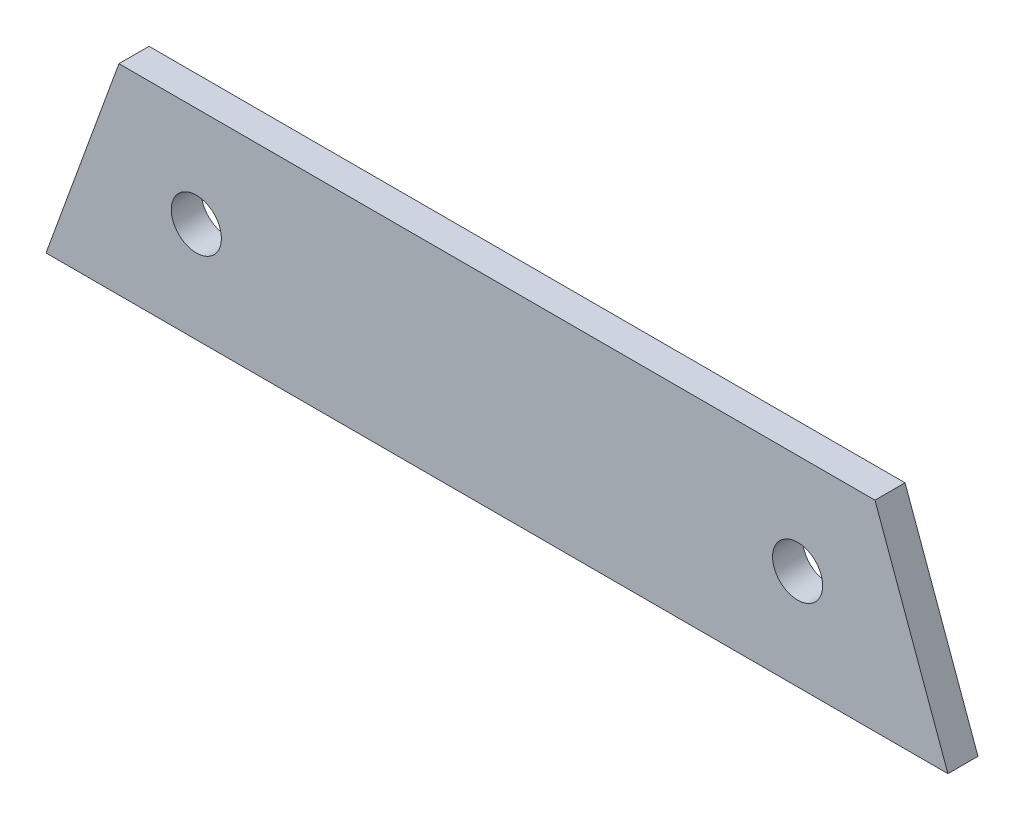
ISO-10303-21;
HEADER;
FILE_DESCRIPTION(('STEP AP214'),'2;1');
FILE_NAME('part.step','',(''),(''),'','','');
FILE_SCHEMA(('AUTOMOTIVE_DESIGN { 1 0 10303 214 1 1 1 1 }'));
ENDSEC;
DATA;
#1=APPLICATION_CONTEXT('core data for automotive mechanical design processes');
#2=APPLICATION_PROTOCOL_DEFINITION('international standard','automotive_design',2000,#1);
#3=PRODUCT_CONTEXT('',#1,'mechanical');
#4=PRODUCT('Part','Part','',(#3));
#5=PRODUCT_RELATED_PRODUCT_CATEGORY('part','',(#4));
#6=PRODUCT_DEFINITION_FORMATION('','',#4);
#7=PRODUCT_DEFINITION_CONTEXT('part definition',#1,'design');
#8=PRODUCT_DEFINITION('design','',#6,#7);
#9=PRODUCT_DEFINITION_SHAPE('','',#8);
#10=(LENGTH_UNIT() NAMED_UNIT(*) SI_UNIT(.MILLI.,.METRE.));
#11=(NAMED_UNIT(*) PLANE_ANGLE_UNIT() SI_UNIT($,.RADIAN.));
#12=(NAMED_UNIT(*) SI_UNIT($,.STERADIAN.) SOLID_ANGLE_UNIT());
#13=UNCERTAINTY_MEASURE_WITH_UNIT(LENGTH_MEASURE(1.E-05),#10,'distance_accuracy_value','');
#14=(GEOMETRIC_REPRESENTATION_CONTEXT(3) GLOBAL_UNCERTAINTY_ASSIGNED_CONTEXT((#13)) GLOBAL_UNIT_ASSIGNED_CONTEXT((#10,
#11,#12)) REPRESENTATION_CONTEXT('',''));
#15=CARTESIAN_POINT('',(0.,0.,0.));
#16=DIRECTION('',(0.,0.,1.));
#17=DIRECTION('',(1.,0.,0.));
#18=AXIS2_PLACEMENT_3D('',#15,#16,#17);
#19=CARTESIAN_POINT('',(0.,0.,3.));
#20=DIRECTION('',(0.,0.,1.));
#21=DIRECTION('',(1.,0.,0.));
#22=AXIS2_PLACEMENT_3D('',#19,#20,#21);
#23=PLANE('',#22);
#24=CARTESIAN_POINT('',(-30.,10.,3.));
#25=DIRECTION('',(0.,0.,1.));
#26=DIRECTION('',(1.,0.,0.));
#27=AXIS2_PLACEMENT_3D('',#24,#25,#26);
#28=CIRCLE('',#27,2.5);
#29=CARTESIAN_POINT('',(-27.5,10.,3.));
#30=VERTEX_POINT('',#29);
#31=EDGE_CURVE('E100',#30,#30,#28,.T.);
#32=ORIENTED_EDGE('',*,*,#31,.F.);
#33=EDGE_LOOP('',(#32));
#34=FACE_BOUND('',#33,.T.);
#35=DIRECTION('',(-0.342020143325673,-0.939692620785907,0.));
#36=VECTOR('',#35,1.);
#37=CARTESIAN_POINT('',(-37.7205953146759,20.,3.));
#38=LINE('',#37,#36);
#39=CARTESIAN_POINT('',(-37.7205953146759,20.,3.));
#40=VERTEX_POINT('',#39);
#41=CARTESIAN_POINT('',(-45.,0.,3.));
#42=VERTEX_POINT('',#41);
#43=EDGE_CURVE('E85',#40,#42,#38,.T.);
#44=ORIENTED_EDGE('',*,*,#43,.T.);
#45=DIRECTION('',(1.,0.,0.));
#46=VECTOR('',#45,1.);
#47=CARTESIAN_POINT('',(-45.,0.,3.));
#48=LINE('',#47,#46);
#49=CARTESIAN_POINT('',(45.,0.,3.));
#50=VERTEX_POINT('',#49);
#51=EDGE_CURVE('E80',#42,#50,#48,.T.);
#52=ORIENTED_EDGE('',*,*,#51,.T.);
#53=DIRECTION('',(-0.342020143325673,0.939692620785907,0.));
#54=VECTOR('',#53,1.);
#55=CARTESIAN_POINT('',(45.,0.,3.));
#56=LINE('',#55,#54);
#57=CARTESIAN_POINT('',(37.7205953146759,20.,3.));
#58=VERTEX_POINT('',#57);
#59=EDGE_CURVE('E83',#50,#58,#56,.T.);
#60=ORIENTED_EDGE('',*,*,#59,.T.);
#61=DIRECTION('',(-1.,0.,0.));
#62=VECTOR('',#61,1.);
#63=CARTESIAN_POINT('',(37.7205953146759,20.,3.));
#64=LINE('',#63,#62);
#65=EDGE_CURVE('E50',#58,#40,#64,.T.);
#66=ORIENTED_EDGE('',*,*,#65,.T.);
#67=EDGE_LOOP('',(#44,#52,#60,#66));
#68=FACE_BOUND('',#67,.T.);
#69=CARTESIAN_POINT('',(30.,10.,3.));
#70=DIRECTION('',(0.,0.,1.));
#71=DIRECTION('',(1.,0.,0.));
#72=AXIS2_PLACEMENT_3D('',#69,#70,#71);
#73=CIRCLE('',#72,2.5);
#74=CARTESIAN_POINT('',(32.5,10.,3.));
#75=VERTEX_POINT('',#74);
#76=EDGE_CURVE('E115',#75,#75,#73,.T.);
#77=ORIENTED_EDGE('',*,*,#76,.F.);
#78=EDGE_LOOP('',(#77));
#79=FACE_BOUND('',#78,.T.);
#80=ADVANCED_FACE('F33',(#34,#68,#79),#23,.T.);
#81=CARTESIAN_POINT('',(0.,0.,0.));
#82=DIRECTION('',(0.,0.,1.));
#83=DIRECTION('',(1.,0.,0.));
#84=AXIS2_PLACEMENT_3D('',#81,#82,#83);
#85=PLANE('',#84);
#86=DIRECTION('',(-0.342020143325673,-0.939692620785907,0.));
#87=VECTOR('',#86,1.);
#88=CARTESIAN_POINT('',(-37.7205953146759,20.,0.));
#89=LINE('',#88,#87);
#90=CARTESIAN_POINT('',(-37.7205953146759,20.,0.));
#91=VERTEX_POINT('',#90);
#92=CARTESIAN_POINT('',(-45.,0.,0.));
#93=VERTEX_POINT('',#92);
#94=EDGE_CURVE('E97',#91,#93,#89,.T.);
#95=ORIENTED_EDGE('',*,*,#94,.F.);
#96=DIRECTION('',(-1.,0.,0.));
#97=VECTOR('',#96,1.);
#98=CARTESIAN_POINT('',(37.7205953146759,20.,0.));
#99=LINE('',#98,#97);
#100=CARTESIAN_POINT('',(37.7205953146759,20.,0.));
#101=VERTEX_POINT('',#100);
#102=EDGE_CURVE('E73',#101,#91,#99,.T.);
#103=ORIENTED_EDGE('',*,*,#102,.F.);
#104=DIRECTION('',(-0.342020143325673,0.939692620785907,0.));
#105=VECTOR('',#104,1.);
#106=CARTESIAN_POINT('',(45.,0.,0.));
#107=LINE('',#106,#105);
#108=CARTESIAN_POINT('',(45.,0.,0.));
#109=VERTEX_POINT('',#108);
#110=EDGE_CURVE('E67',#109,#101,#107,.T.);
#111=ORIENTED_EDGE('',*,*,#110,.F.);
#112=DIRECTION('',(1.,0.,0.));
#113=VECTOR('',#112,1.);
#114=CARTESIAN_POINT('',(-45.,0.,0.));
#115=LINE('',#114,#113);
#116=EDGE_CURVE('E89',#93,#109,#115,.T.);
#117=ORIENTED_EDGE('',*,*,#116,.F.);
#118=EDGE_LOOP('',(#95,#103,#111,#117));
#119=FACE_BOUND('',#118,.T.);
#120=CARTESIAN_POINT('',(-30.,10.,0.));
#121=DIRECTION('',(0.,0.,1.));
#122=DIRECTION('',(1.,0.,0.));
#123=AXIS2_PLACEMENT_3D('',#120,#121,#122);
#124=CIRCLE('',#123,2.5);
#125=CARTESIAN_POINT('',(-27.5,10.,0.));
#126=VERTEX_POINT('',#125);
#127=EDGE_CURVE('E112',#126,#126,#124,.T.);
#128=ORIENTED_EDGE('',*,*,#127,.T.);
#129=EDGE_LOOP('',(#128));
#130=FACE_BOUND('',#129,.T.);
#131=CARTESIAN_POINT('',(30.,10.,0.));
#132=DIRECTION('',(0.,0.,1.));
#133=DIRECTION('',(1.,0.,0.));
#134=AXIS2_PLACEMENT_3D('',#131,#132,#133);
#135=CIRCLE('',#134,2.5);
#136=CARTESIAN_POINT('',(32.5,10.,0.));
#137=VERTEX_POINT('',#136);
#138=EDGE_CURVE('E118',#137,#137,#135,.T.);
#139=ORIENTED_EDGE('',*,*,#138,.T.);
#140=EDGE_LOOP('',(#139));
#141=FACE_BOUND('',#140,.T.);
#142=ADVANCED_FACE('F108',(#119,#130,#141),#85,.F.);
#143=CARTESIAN_POINT('',(-37.7205953146759,20.,3.));
#144=DIRECTION('',(0.939692620785907,-0.342020143325672,0.));
#145=DIRECTION('',(0.342020143325672,0.939692620785907,0.));
#146=AXIS2_PLACEMENT_3D('',#143,#144,#145);
#147=PLANE('',#146);
#148=ORIENTED_EDGE('',*,*,#94,.T.);
#149=DIRECTION('',(0.,0.,-1.));
#150=VECTOR('',#149,1.);
#151=CARTESIAN_POINT('',(-45.,0.,3.));
#152=LINE('',#151,#150);
#153=EDGE_CURVE('E11',#42,#93,#152,.T.);
#154=ORIENTED_EDGE('',*,*,#153,.F.);
#155=ORIENTED_EDGE('',*,*,#43,.F.);
#156=DIRECTION('',(0.,0.,-1.));
#157=VECTOR('',#156,1.);
#158=CARTESIAN_POINT('',(-37.7205953146759,20.,3.));
#159=LINE('',#158,#157);
#160=EDGE_CURVE('E93',#40,#91,#159,.T.);
#161=ORIENTED_EDGE('',*,*,#160,.T.);
#162=EDGE_LOOP('',(#148,#154,#155,#161));
#163=FACE_BOUND('',#162,.T.);
#164=ADVANCED_FACE('F35',(#163),#147,.F.);
#165=CARTESIAN_POINT('',(-45.,0.,3.));
#166=DIRECTION('',(0.,1.,0.));
#167=DIRECTION('',(0.,0.,1.));
#168=AXIS2_PLACEMENT_3D('',#165,#166,#167);
#169=PLANE('',#168);
#170=ORIENTED_EDGE('',*,*,#116,.T.);
#171=DIRECTION('',(0.,0.,-1.));
#172=VECTOR('',#171,1.);
#173=CARTESIAN_POINT('',(45.,0.,3.));
#174=LINE('',#173,#172);
#175=EDGE_CURVE('E42',#50,#109,#174,.T.);
#176=ORIENTED_EDGE('',*,*,#175,.F.);
#177=ORIENTED_EDGE('',*,*,#51,.F.);
#178=ORIENTED_EDGE('',*,*,#153,.T.);
#179=EDGE_LOOP('',(#170,#176,#177,#178));
#180=FACE_BOUND('',#179,.T.);
#181=ADVANCED_FACE('F88',(#180),#169,.F.);
#182=CARTESIAN_POINT('',(45.,0.,3.));
#183=DIRECTION('',(-0.939692620785907,-0.342020143325673,0.));
#184=DIRECTION('',(0.342020143325673,-0.939692620785907,0.));
#185=AXIS2_PLACEMENT_3D('',#182,#183,#184);
#186=PLANE('',#185);
#187=ORIENTED_EDGE('',*,*,#110,.T.);
#188=DIRECTION('',(0.,0.,-1.));
#189=VECTOR('',#188,1.);
#190=CARTESIAN_POINT('',(37.7205953146759,20.,3.));
#191=LINE('',#190,#189);
#192=EDGE_CURVE('E90',#58,#101,#191,.T.);
#193=ORIENTED_EDGE('',*,*,#192,.F.);
#194=ORIENTED_EDGE('',*,*,#59,.F.);
#195=ORIENTED_EDGE('',*,*,#175,.T.);
#196=EDGE_LOOP('',(#187,#193,#194,#195));
#197=FACE_BOUND('',#196,.T.);
#198=ADVANCED_FACE('F91',(#197),#186,.F.);
#199=CARTESIAN_POINT('',(37.7205953146759,20.,3.));
#200=DIRECTION('',(0.,-1.,0.));
#201=DIRECTION('',(1.,0.,0.));
#202=AXIS2_PLACEMENT_3D('',#199,#200,#201);
#203=PLANE('',#202);
#204=ORIENTED_EDGE('',*,*,#102,.T.);
#205=ORIENTED_EDGE('',*,*,#160,.F.);
#206=ORIENTED_EDGE('',*,*,#65,.F.);
#207=ORIENTED_EDGE('',*,*,#192,.T.);
#208=EDGE_LOOP('',(#204,#205,#206,#207));
#209=FACE_BOUND('',#208,.T.);
#210=ADVANCED_FACE('F105',(#209),#203,.F.);
#211=CARTESIAN_POINT('',(-30.,10.,3.));
#212=DIRECTION('',(0.,0.,-1.));
#213=DIRECTION('',(-1.,0.,0.));
#214=AXIS2_PLACEMENT_3D('',#211,#212,#213);
#215=CYLINDRICAL_SURFACE('',#214,2.5);
#216=ORIENTED_EDGE('',*,*,#31,.T.);
#217=EDGE_LOOP('',(#216));
#218=FACE_BOUND('',#217,.T.);
#219=ORIENTED_EDGE('',*,*,#127,.F.);
#220=EDGE_LOOP('',(#219));
#221=FACE_BOUND('',#220,.T.);
#222=ADVANCED_FACE('F135',(#218,#221),#215,.F.);
#223=CARTESIAN_POINT('',(30.,10.,3.));
#224=DIRECTION('',(0.,0.,-1.));
#225=DIRECTION('',(-1.,0.,0.));
#226=AXIS2_PLACEMENT_3D('',#223,#224,#225);
#227=CYLINDRICAL_SURFACE('',#226,2.5);
#228=ORIENTED_EDGE('',*,*,#76,.T.);
#229=EDGE_LOOP('',(#228));
#230=FACE_BOUND('',#229,.T.);
#231=ORIENTED_EDGE('',*,*,#138,.F.);
#232=EDGE_LOOP('',(#231));
#233=FACE_BOUND('',#232,.T.);
#234=ADVANCED_FACE('F124',(#230,#233),#227,.F.);
#235=CLOSED_SHELL('',(#80,#142,#164,#181,#198,#210,#222,#234));
#236=MANIFOLD_SOLID_BREP('B2',#235);
#237=ADVANCED_BREP_SHAPE_REPRESENTATION('',(#18,#236),#14);
#238=SHAPE_DEFINITION_REPRESENTATION(#9,#237);
ENDSEC;
END-ISO-10303-21;
